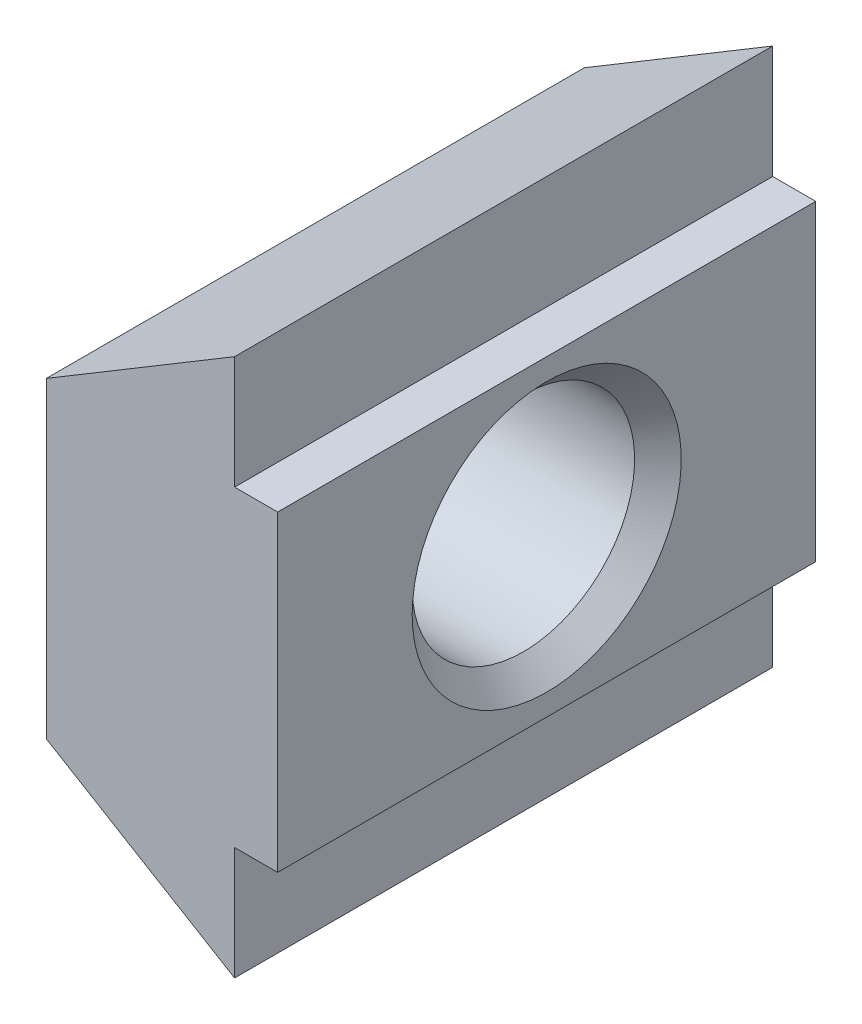
ISO-10303-21;
HEADER;
FILE_DESCRIPTION(('STEP AP214'),'2;1');
FILE_NAME('part.step','',(''),(''),'','','');
FILE_SCHEMA(('AUTOMOTIVE_DESIGN { 1 0 10303 214 1 1 1 1 }'));
ENDSEC;
DATA;
#1=APPLICATION_CONTEXT('core data for automotive mechanical design processes');
#2=APPLICATION_PROTOCOL_DEFINITION('international standard','automotive_design',2000,#1);
#3=PRODUCT_CONTEXT('',#1,'mechanical');
#4=PRODUCT('Part','Part','',(#3));
#5=PRODUCT_RELATED_PRODUCT_CATEGORY('part','',(#4));
#6=PRODUCT_DEFINITION_FORMATION('','',#4);
#7=PRODUCT_DEFINITION_CONTEXT('part definition',#1,'design');
#8=PRODUCT_DEFINITION('design','',#6,#7);
#9=PRODUCT_DEFINITION_SHAPE('','',#8);
#10=(LENGTH_UNIT() NAMED_UNIT(*) SI_UNIT(.MILLI.,.METRE.));
#11=(NAMED_UNIT(*) PLANE_ANGLE_UNIT() SI_UNIT($,.RADIAN.));
#12=(NAMED_UNIT(*) SI_UNIT($,.STERADIAN.) SOLID_ANGLE_UNIT());
#13=UNCERTAINTY_MEASURE_WITH_UNIT(LENGTH_MEASURE(1.E-05),#10,'distance_accuracy_value','');
#14=(GEOMETRIC_REPRESENTATION_CONTEXT(3) GLOBAL_UNCERTAINTY_ASSIGNED_CONTEXT((#13)) GLOBAL_UNIT_ASSIGNED_CONTEXT((#10,
#11,#12)) REPRESENTATION_CONTEXT('',''));
#15=CARTESIAN_POINT('',(0.,0.,0.));
#16=DIRECTION('',(0.,0.,1.));
#17=DIRECTION('',(1.,0.,0.));
#18=AXIS2_PLACEMENT_3D('',#15,#16,#17);
#19=CARTESIAN_POINT('',(-4.3,2.9,5.));
#20=DIRECTION('',(1.,0.,0.));
#21=DIRECTION('',(0.,0.,-1.));
#22=AXIS2_PLACEMENT_3D('',#19,#20,#21);
#23=PLANE('',#22);
#24=DIRECTION('',(0.,0.,-1.));
#25=VECTOR('',#24,1.);
#26=CARTESIAN_POINT('',(-4.3,2.9,5.));
#27=LINE('',#26,#25);
#28=CARTESIAN_POINT('',(-4.3,2.9,5.));
#29=VERTEX_POINT('',#28);
#30=CARTESIAN_POINT('',(-4.3,2.9,-5.));
#31=VERTEX_POINT('',#30);
#32=EDGE_CURVE('E11',#29,#31,#27,.T.);
#33=ORIENTED_EDGE('',*,*,#32,.T.);
#34=DIRECTION('',(0.,-1.,0.));
#35=VECTOR('',#34,1.);
#36=CARTESIAN_POINT('',(-4.3,2.9,-5.));
#37=LINE('',#36,#35);
#38=CARTESIAN_POINT('',(-4.3,-2.9,-5.));
#39=VERTEX_POINT('',#38);
#40=EDGE_CURVE('E102',#31,#39,#37,.T.);
#41=ORIENTED_EDGE('',*,*,#40,.T.);
#42=DIRECTION('',(0.,0.,-1.));
#43=VECTOR('',#42,1.);
#44=CARTESIAN_POINT('',(-4.3,-2.9,5.));
#45=LINE('',#44,#43);
#46=CARTESIAN_POINT('',(-4.3,-2.9,5.));
#47=VERTEX_POINT('',#46);
#48=EDGE_CURVE('E43',#47,#39,#45,.T.);
#49=ORIENTED_EDGE('',*,*,#48,.F.);
#50=DIRECTION('',(0.,-1.,0.));
#51=VECTOR('',#50,1.);
#52=CARTESIAN_POINT('',(-4.3,2.9,5.));
#53=LINE('',#52,#51);
#54=EDGE_CURVE('E103',#29,#47,#53,.T.);
#55=ORIENTED_EDGE('',*,*,#54,.F.);
#56=EDGE_LOOP('',(#33,#41,#49,#55));
#57=FACE_BOUND('',#56,.T.);
#58=CARTESIAN_POINT('',(-4.3,0.,0.));
#59=DIRECTION('',(-1.,0.,0.));
#60=DIRECTION('',(0.,0.,1.));
#61=AXIS2_PLACEMENT_3D('',#58,#59,#60);
#62=CIRCLE('',#61,2.5);
#63=CARTESIAN_POINT('',(-4.3,0.,2.5));
#64=VERTEX_POINT('',#63);
#65=EDGE_CURVE('E119',#64,#64,#62,.T.);
#66=ORIENTED_EDGE('',*,*,#65,.F.);
#67=EDGE_LOOP('',(#66));
#68=FACE_BOUND('',#67,.T.);
#69=ADVANCED_FACE('F35',(#57,#68),#23,.F.);
#70=CARTESIAN_POINT('',(0.,-2.9,5.));
#71=DIRECTION('',(-1.,0.,0.));
#72=DIRECTION('',(0.,0.,1.));
#73=AXIS2_PLACEMENT_3D('',#70,#71,#72);
#74=PLANE('',#73);
#75=DIRECTION('',(0.,0.,-1.));
#76=VECTOR('',#75,1.);
#77=CARTESIAN_POINT('',(0.,-2.9,5.));
#78=LINE('',#77,#76);
#79=CARTESIAN_POINT('',(0.,-2.9,5.));
#80=VERTEX_POINT('',#79);
#81=CARTESIAN_POINT('',(0.,-2.9,-5.));
#82=VERTEX_POINT('',#81);
#83=EDGE_CURVE('E159',#80,#82,#78,.T.);
#84=ORIENTED_EDGE('',*,*,#83,.T.);
#85=DIRECTION('',(0.,1.,0.));
#86=VECTOR('',#85,1.);
#87=CARTESIAN_POINT('',(0.,-2.9,-5.));
#88=LINE('',#87,#86);
#89=CARTESIAN_POINT('',(0.,2.9,-5.));
#90=VERTEX_POINT('',#89);
#91=EDGE_CURVE('E133',#82,#90,#88,.T.);
#92=ORIENTED_EDGE('',*,*,#91,.T.);
#93=DIRECTION('',(0.,0.,-1.));
#94=VECTOR('',#93,1.);
#95=CARTESIAN_POINT('',(0.,2.9,5.));
#96=LINE('',#95,#94);
#97=CARTESIAN_POINT('',(0.,2.9,5.));
#98=VERTEX_POINT('',#97);
#99=EDGE_CURVE('E157',#98,#90,#96,.T.);
#100=ORIENTED_EDGE('',*,*,#99,.F.);
#101=DIRECTION('',(0.,1.,0.));
#102=VECTOR('',#101,1.);
#103=CARTESIAN_POINT('',(0.,-2.9,5.));
#104=LINE('',#103,#102);
#105=EDGE_CURVE('E150',#80,#98,#104,.T.);
#106=ORIENTED_EDGE('',*,*,#105,.F.);
#107=EDGE_LOOP('',(#84,#92,#100,#106));
#108=FACE_BOUND('',#107,.T.);
#109=CARTESIAN_POINT('',(0.,0.,0.));
#110=DIRECTION('',(-1.,0.,0.));
#111=DIRECTION('',(0.,0.,1.));
#112=AXIS2_PLACEMENT_3D('',#109,#110,#111);
#113=CIRCLE('',#112,2.5);
#114=CARTESIAN_POINT('',(0.,0.,2.5));
#115=VERTEX_POINT('',#114);
#116=EDGE_CURVE('E291',#115,#115,#113,.T.);
#117=ORIENTED_EDGE('',*,*,#116,.T.);
#118=EDGE_LOOP('',(#117));
#119=FACE_BOUND('',#118,.T.);
#120=ADVANCED_FACE('F182',(#108,#119),#74,.F.);
#121=CARTESIAN_POINT('',(-0.8,5.,5.));
#122=DIRECTION('',(0.514495755427527,-0.857492925712544,0.));
#123=DIRECTION('',(0.857492925712544,0.514495755427527,0.));
#124=AXIS2_PLACEMENT_3D('',#121,#122,#123);
#125=PLANE('',#124);
#126=DIRECTION('',(0.,0.,-1.));
#127=VECTOR('',#126,1.);
#128=CARTESIAN_POINT('',(-0.8,5.,5.));
#129=LINE('',#128,#127);
#130=CARTESIAN_POINT('',(-0.8,5.,5.));
#131=VERTEX_POINT('',#130);
#132=CARTESIAN_POINT('',(-0.8,5.,-5.));
#133=VERTEX_POINT('',#132);
#134=EDGE_CURVE('E118',#131,#133,#129,.T.);
#135=ORIENTED_EDGE('',*,*,#134,.T.);
#136=DIRECTION('',(-0.857492925712544,-0.514495755427527,0.));
#137=VECTOR('',#136,1.);
#138=CARTESIAN_POINT('',(-0.8,5.,-5.));
#139=LINE('',#138,#137);
#140=EDGE_CURVE('E112',#133,#31,#139,.T.);
#141=ORIENTED_EDGE('',*,*,#140,.T.);
#142=ORIENTED_EDGE('',*,*,#32,.F.);
#143=DIRECTION('',(-0.857492925712544,-0.514495755427527,0.));
#144=VECTOR('',#143,1.);
#145=CARTESIAN_POINT('',(-0.8,5.,5.));
#146=LINE('',#145,#144);
#147=EDGE_CURVE('E141',#131,#29,#146,.T.);
#148=ORIENTED_EDGE('',*,*,#147,.F.);
#149=EDGE_LOOP('',(#135,#141,#142,#148));
#150=FACE_BOUND('',#149,.T.);
#151=ADVANCED_FACE('F37',(#150),#125,.F.);
#152=CARTESIAN_POINT('',(-4.3,-2.9,5.));
#153=DIRECTION('',(0.514495755427527,0.857492925712544,0.));
#154=DIRECTION('',(-0.857492925712544,0.514495755427527,0.));
#155=AXIS2_PLACEMENT_3D('',#152,#153,#154);
#156=PLANE('',#155);
#157=ORIENTED_EDGE('',*,*,#48,.T.);
#158=DIRECTION('',(0.857492925712544,-0.514495755427527,0.));
#159=VECTOR('',#158,1.);
#160=CARTESIAN_POINT('',(-4.3,-2.9,-5.));
#161=LINE('',#160,#159);
#162=CARTESIAN_POINT('',(-0.8,-5.,-5.));
#163=VERTEX_POINT('',#162);
#164=EDGE_CURVE('E116',#39,#163,#161,.T.);
#165=ORIENTED_EDGE('',*,*,#164,.T.);
#166=DIRECTION('',(0.,0.,-1.));
#167=VECTOR('',#166,1.);
#168=CARTESIAN_POINT('',(-0.8,-5.,5.));
#169=LINE('',#168,#167);
#170=CARTESIAN_POINT('',(-0.8,-5.,5.));
#171=VERTEX_POINT('',#170);
#172=EDGE_CURVE('E163',#171,#163,#169,.T.);
#173=ORIENTED_EDGE('',*,*,#172,.F.);
#174=DIRECTION('',(0.857492925712544,-0.514495755427527,0.));
#175=VECTOR('',#174,1.);
#176=CARTESIAN_POINT('',(-4.3,-2.9,5.));
#177=LINE('',#176,#175);
#178=EDGE_CURVE('E144',#47,#171,#177,.T.);
#179=ORIENTED_EDGE('',*,*,#178,.F.);
#180=EDGE_LOOP('',(#157,#165,#173,#179));
#181=FACE_BOUND('',#180,.T.);
#182=ADVANCED_FACE('F166',(#181),#156,.F.);
#183=CARTESIAN_POINT('',(-0.8,-5.,5.));
#184=DIRECTION('',(-1.,0.,0.));
#185=DIRECTION('',(0.,0.,1.));
#186=AXIS2_PLACEMENT_3D('',#183,#184,#185);
#187=PLANE('',#186);
#188=ORIENTED_EDGE('',*,*,#172,.T.);
#189=DIRECTION('',(0.,1.,0.));
#190=VECTOR('',#189,1.);
#191=CARTESIAN_POINT('',(-0.8,-5.,-5.));
#192=LINE('',#191,#190);
#193=CARTESIAN_POINT('',(-0.8,-2.9,-5.));
#194=VERTEX_POINT('',#193);
#195=EDGE_CURVE('E127',#163,#194,#192,.T.);
#196=ORIENTED_EDGE('',*,*,#195,.T.);
#197=DIRECTION('',(0.,0.,-1.));
#198=VECTOR('',#197,1.);
#199=CARTESIAN_POINT('',(-0.8,-2.9,5.));
#200=LINE('',#199,#198);
#201=CARTESIAN_POINT('',(-0.8,-2.9,5.));
#202=VERTEX_POINT('',#201);
#203=EDGE_CURVE('E161',#202,#194,#200,.T.);
#204=ORIENTED_EDGE('',*,*,#203,.F.);
#205=DIRECTION('',(0.,1.,0.));
#206=VECTOR('',#205,1.);
#207=CARTESIAN_POINT('',(-0.8,-5.,5.));
#208=LINE('',#207,#206);
#209=EDGE_CURVE('E146',#171,#202,#208,.T.);
#210=ORIENTED_EDGE('',*,*,#209,.F.);
#211=EDGE_LOOP('',(#188,#196,#204,#210));
#212=FACE_BOUND('',#211,.T.);
#213=ADVANCED_FACE('F174',(#212),#187,.F.);
#214=CARTESIAN_POINT('',(-0.8,-2.9,5.));
#215=DIRECTION('',(0.,1.,0.));
#216=DIRECTION('',(0.,0.,1.));
#217=AXIS2_PLACEMENT_3D('',#214,#215,#216);
#218=PLANE('',#217);
#219=ORIENTED_EDGE('',*,*,#203,.T.);
#220=DIRECTION('',(1.,0.,0.));
#221=VECTOR('',#220,1.);
#222=CARTESIAN_POINT('',(-0.8,-2.9,-5.));
#223=LINE('',#222,#221);
#224=EDGE_CURVE('E130',#194,#82,#223,.T.);
#225=ORIENTED_EDGE('',*,*,#224,.T.);
#226=ORIENTED_EDGE('',*,*,#83,.F.);
#227=DIRECTION('',(1.,0.,0.));
#228=VECTOR('',#227,1.);
#229=CARTESIAN_POINT('',(-0.8,-2.9,5.));
#230=LINE('',#229,#228);
#231=EDGE_CURVE('E148',#202,#80,#230,.T.);
#232=ORIENTED_EDGE('',*,*,#231,.F.);
#233=EDGE_LOOP('',(#219,#225,#226,#232));
#234=FACE_BOUND('',#233,.T.);
#235=ADVANCED_FACE('F177',(#234),#218,.F.);
#236=CARTESIAN_POINT('',(0.,2.9,5.));
#237=DIRECTION('',(0.,-1.,0.));
#238=DIRECTION('',(0.,0.,-1.));
#239=AXIS2_PLACEMENT_3D('',#236,#237,#238);
#240=PLANE('',#239);
#241=ORIENTED_EDGE('',*,*,#99,.T.);
#242=DIRECTION('',(-1.,0.,0.));
#243=VECTOR('',#242,1.);
#244=CARTESIAN_POINT('',(0.,2.9,-5.));
#245=LINE('',#244,#243);
#246=CARTESIAN_POINT('',(-0.8,2.9,-5.));
#247=VERTEX_POINT('',#246);
#248=EDGE_CURVE('E136',#90,#247,#245,.T.);
#249=ORIENTED_EDGE('',*,*,#248,.T.);
#250=DIRECTION('',(0.,0.,-1.));
#251=VECTOR('',#250,1.);
#252=CARTESIAN_POINT('',(-0.8,2.9,5.));
#253=LINE('',#252,#251);
#254=CARTESIAN_POINT('',(-0.8,2.9,5.));
#255=VERTEX_POINT('',#254);
#256=EDGE_CURVE('E155',#255,#247,#253,.T.);
#257=ORIENTED_EDGE('',*,*,#256,.F.);
#258=DIRECTION('',(-1.,0.,0.));
#259=VECTOR('',#258,1.);
#260=CARTESIAN_POINT('',(0.,2.9,5.));
#261=LINE('',#260,#259);
#262=EDGE_CURVE('E55',#98,#255,#261,.T.);
#263=ORIENTED_EDGE('',*,*,#262,.F.);
#264=EDGE_LOOP('',(#241,#249,#257,#263));
#265=FACE_BOUND('',#264,.T.);
#266=ADVANCED_FACE('F186',(#265),#240,.F.);
#267=CARTESIAN_POINT('',(-0.8,2.9,5.));
#268=DIRECTION('',(-1.,0.,0.));
#269=DIRECTION('',(0.,0.,1.));
#270=AXIS2_PLACEMENT_3D('',#267,#268,#269);
#271=PLANE('',#270);
#272=ORIENTED_EDGE('',*,*,#256,.T.);
#273=DIRECTION('',(0.,1.,0.));
#274=VECTOR('',#273,1.);
#275=CARTESIAN_POINT('',(-0.8,2.9,-5.));
#276=LINE('',#275,#274);
#277=EDGE_CURVE('E139',#247,#133,#276,.T.);
#278=ORIENTED_EDGE('',*,*,#277,.T.);
#279=ORIENTED_EDGE('',*,*,#134,.F.);
#280=DIRECTION('',(0.,1.,0.));
#281=VECTOR('',#280,1.);
#282=CARTESIAN_POINT('',(-0.8,2.9,5.));
#283=LINE('',#282,#281);
#284=EDGE_CURVE('E50',#255,#131,#283,.T.);
#285=ORIENTED_EDGE('',*,*,#284,.F.);
#286=EDGE_LOOP('',(#272,#278,#279,#285));
#287=FACE_BOUND('',#286,.T.);
#288=ADVANCED_FACE('F188',(#287),#271,.F.);
#289=CARTESIAN_POINT('',(0.,0.,5.));
#290=DIRECTION('',(0.,0.,1.));
#291=DIRECTION('',(1.,0.,0.));
#292=AXIS2_PLACEMENT_3D('',#289,#290,#291);
#293=PLANE('',#292);
#294=ORIENTED_EDGE('',*,*,#147,.T.);
#295=ORIENTED_EDGE('',*,*,#54,.T.);
#296=ORIENTED_EDGE('',*,*,#178,.T.);
#297=ORIENTED_EDGE('',*,*,#209,.T.);
#298=ORIENTED_EDGE('',*,*,#231,.T.);
#299=ORIENTED_EDGE('',*,*,#105,.T.);
#300=ORIENTED_EDGE('',*,*,#262,.T.);
#301=ORIENTED_EDGE('',*,*,#284,.T.);
#302=EDGE_LOOP('',(#294,#295,#296,#297,#298,#299,#300,#301));
#303=FACE_BOUND('',#302,.T.);
#304=ADVANCED_FACE('F169',(#303),#293,.T.);
#305=CARTESIAN_POINT('',(0.,0.,-5.));
#306=DIRECTION('',(0.,0.,1.));
#307=DIRECTION('',(1.,0.,0.));
#308=AXIS2_PLACEMENT_3D('',#305,#306,#307);
#309=PLANE('',#308);
#310=ORIENTED_EDGE('',*,*,#140,.F.);
#311=ORIENTED_EDGE('',*,*,#277,.F.);
#312=ORIENTED_EDGE('',*,*,#248,.F.);
#313=ORIENTED_EDGE('',*,*,#91,.F.);
#314=ORIENTED_EDGE('',*,*,#224,.F.);
#315=ORIENTED_EDGE('',*,*,#195,.F.);
#316=ORIENTED_EDGE('',*,*,#164,.F.);
#317=ORIENTED_EDGE('',*,*,#40,.F.);
#318=EDGE_LOOP('',(#310,#311,#312,#313,#314,#315,#316,#317));
#319=FACE_BOUND('',#318,.T.);
#320=ADVANCED_FACE('F110',(#319),#309,.F.);
#321=CARTESIAN_POINT('',(-3.867,0.,0.));
#322=DIRECTION('',(-1.,0.,0.));
#323=DIRECTION('',(0.,0.,1.));
#324=AXIS2_PLACEMENT_3D('',#321,#322,#323);
#325=CONICAL_SURFACE('',#324,2.067,0.785398163397449);
#326=ORIENTED_EDGE('',*,*,#65,.T.);
#327=EDGE_LOOP('',(#326));
#328=FACE_BOUND('',#327,.T.);
#329=CARTESIAN_POINT('',(-3.867,0.,0.));
#330=DIRECTION('',(-1.,0.,0.));
#331=DIRECTION('',(0.,0.,1.));
#332=AXIS2_PLACEMENT_3D('',#329,#330,#331);
#333=CIRCLE('',#332,2.067);
#334=CARTESIAN_POINT('',(-3.867,0.,2.067));
#335=VERTEX_POINT('',#334);
#336=EDGE_CURVE('E122',#335,#335,#333,.T.);
#337=ORIENTED_EDGE('',*,*,#336,.F.);
#338=EDGE_LOOP('',(#337));
#339=FACE_BOUND('',#338,.T.);
#340=ADVANCED_FACE('F236',(#328,#339),#325,.F.);
#341=CARTESIAN_POINT('',(0.,0.,0.));
#342=DIRECTION('',(-1.,0.,0.));
#343=DIRECTION('',(0.,0.,1.));
#344=AXIS2_PLACEMENT_3D('',#341,#342,#343);
#345=CYLINDRICAL_SURFACE('',#344,2.067);
#346=ORIENTED_EDGE('',*,*,#336,.T.);
#347=EDGE_LOOP('',(#346));
#348=FACE_BOUND('',#347,.T.);
#349=CARTESIAN_POINT('',(-0.433,0.,0.));
#350=DIRECTION('',(-1.,0.,0.));
#351=DIRECTION('',(0.,0.,1.));
#352=AXIS2_PLACEMENT_3D('',#349,#350,#351);
#353=CIRCLE('',#352,2.067);
#354=CARTESIAN_POINT('',(-0.433,0.,2.067));
#355=VERTEX_POINT('',#354);
#356=EDGE_CURVE('E288',#355,#355,#353,.T.);
#357=ORIENTED_EDGE('',*,*,#356,.F.);
#358=EDGE_LOOP('',(#357));
#359=FACE_BOUND('',#358,.T.);
#360=ADVANCED_FACE('F259',(#348,#359),#345,.F.);
#361=CARTESIAN_POINT('',(0.,0.,0.));
#362=DIRECTION('',(1.,0.,0.));
#363=DIRECTION('',(0.,0.,-1.));
#364=AXIS2_PLACEMENT_3D('',#361,#362,#363);
#365=CONICAL_SURFACE('',#364,2.5,0.785398163397449);
#366=ORIENTED_EDGE('',*,*,#356,.T.);
#367=EDGE_LOOP('',(#366));
#368=FACE_BOUND('',#367,.T.);
#369=ORIENTED_EDGE('',*,*,#116,.F.);
#370=EDGE_LOOP('',(#369));
#371=FACE_BOUND('',#370,.T.);
#372=ADVANCED_FACE('F270',(#368,#371),#365,.F.);
#373=CLOSED_SHELL('',(#69,#120,#151,#182,#213,#235,#266,#288,#304,#320,#340,#360,#372));
#374=MANIFOLD_SOLID_BREP('B2',#373);
#375=ADVANCED_BREP_SHAPE_REPRESENTATION('',(#18,#374),#14);
#376=SHAPE_DEFINITION_REPRESENTATION(#9,#375);
ENDSEC;
END-ISO-10303-21;
